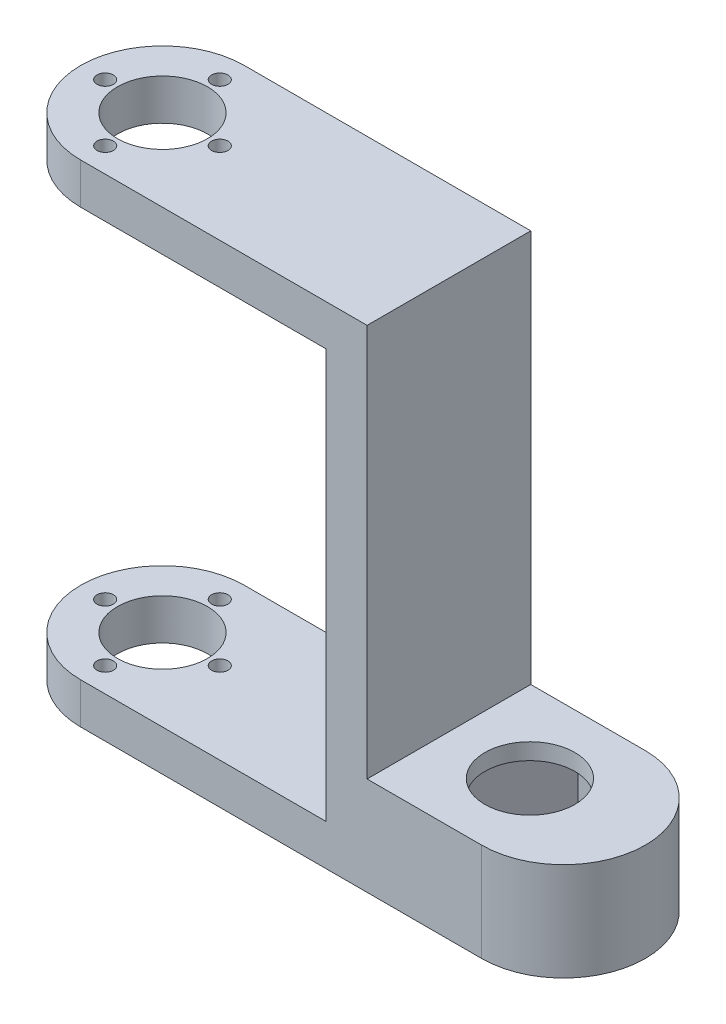
ISO-10303-21;
HEADER;
FILE_DESCRIPTION(('STEP AP214'),'2;1');
FILE_NAME('part.step','',(''),(''),'','','');
FILE_SCHEMA(('AUTOMOTIVE_DESIGN { 1 0 10303 214 1 1 1 1 }'));
ENDSEC;
DATA;
#1=APPLICATION_CONTEXT('core data for automotive mechanical design processes');
#2=APPLICATION_PROTOCOL_DEFINITION('international standard','automotive_design',2000,#1);
#3=PRODUCT_CONTEXT('',#1,'mechanical');
#4=PRODUCT('Part','Part','',(#3));
#5=PRODUCT_RELATED_PRODUCT_CATEGORY('part','',(#4));
#6=PRODUCT_DEFINITION_FORMATION('','',#4);
#7=PRODUCT_DEFINITION_CONTEXT('part definition',#1,'design');
#8=PRODUCT_DEFINITION('design','',#6,#7);
#9=PRODUCT_DEFINITION_SHAPE('','',#8);
#10=(LENGTH_UNIT() NAMED_UNIT(*) SI_UNIT(.MILLI.,.METRE.));
#11=(NAMED_UNIT(*) PLANE_ANGLE_UNIT() SI_UNIT($,.RADIAN.));
#12=(NAMED_UNIT(*) SI_UNIT($,.STERADIAN.) SOLID_ANGLE_UNIT());
#13=UNCERTAINTY_MEASURE_WITH_UNIT(LENGTH_MEASURE(1.E-05),#10,'distance_accuracy_value','');
#14=(GEOMETRIC_REPRESENTATION_CONTEXT(3) GLOBAL_UNCERTAINTY_ASSIGNED_CONTEXT((#13)) GLOBAL_UNIT_ASSIGNED_CONTEXT((#10,
#11,#12)) REPRESENTATION_CONTEXT('',''));
#15=CARTESIAN_POINT('',(0.,0.,0.));
#16=DIRECTION('',(0.,0.,1.));
#17=DIRECTION('',(1.,0.,0.));
#18=AXIS2_PLACEMENT_3D('',#15,#16,#17);
#19=CARTESIAN_POINT('',(36.5,-30.,10.));
#20=DIRECTION('',(0.,-1.,0.));
#21=DIRECTION('',(1.,0.,0.));
#22=AXIS2_PLACEMENT_3D('',#19,#20,#21);
#23=CYLINDRICAL_SURFACE('',#22,10.);
#24=DIRECTION('',(0.,-1.,0.));
#25=VECTOR('',#24,1.);
#26=CARTESIAN_POINT('',(36.5,0.,20.));
#27=LINE('',#26,#25);
#28=CARTESIAN_POINT('',(36.5,-30.,20.));
#29=VERTEX_POINT('',#28);
#30=CARTESIAN_POINT('',(36.5,-18.,20.));
#31=VERTEX_POINT('',#30);
#32=EDGE_CURVE('E331',#29,#31,#27,.F.);
#33=ORIENTED_EDGE('',*,*,#32,.F.);
#34=CARTESIAN_POINT('',(36.5,-30.,10.));
#35=DIRECTION('',(0.,1.,0.));
#36=DIRECTION('',(-1.,0.,0.));
#37=AXIS2_PLACEMENT_3D('',#34,#35,#36);
#38=CIRCLE('',#37,10.);
#39=CARTESIAN_POINT('',(36.5,-30.,0.));
#40=VERTEX_POINT('',#39);
#41=EDGE_CURVE('E49',#40,#29,#38,.F.);
#42=ORIENTED_EDGE('',*,*,#41,.F.);
#43=DIRECTION('',(0.,1.,0.));
#44=VECTOR('',#43,1.);
#45=CARTESIAN_POINT('',(36.5,-30.,0.));
#46=LINE('',#45,#44);
#47=CARTESIAN_POINT('',(36.5,-18.,0.));
#48=VERTEX_POINT('',#47);
#49=EDGE_CURVE('E346',#48,#40,#46,.F.);
#50=ORIENTED_EDGE('',*,*,#49,.F.);
#51=CARTESIAN_POINT('',(36.5,-18.,10.));
#52=DIRECTION('',(0.,-1.,0.));
#53=DIRECTION('',(1.,0.,0.));
#54=AXIS2_PLACEMENT_3D('',#51,#52,#53);
#55=CIRCLE('',#54,10.);
#56=EDGE_CURVE('E11',#31,#48,#55,.F.);
#57=ORIENTED_EDGE('',*,*,#56,.F.);
#58=EDGE_LOOP('',(#33,#42,#50,#57));
#59=FACE_BOUND('',#58,.T.);
#60=ADVANCED_FACE('F41',(#59),#23,.T.);
#61=CARTESIAN_POINT('',(-12.5,-25.,10.));
#62=DIRECTION('',(0.,-1.,0.));
#63=DIRECTION('',(1.,0.,0.));
#64=AXIS2_PLACEMENT_3D('',#61,#62,#63);
#65=CYLINDRICAL_SURFACE('',#64,10.);
#66=DIRECTION('',(0.,1.,0.));
#67=VECTOR('',#66,1.);
#68=CARTESIAN_POINT('',(-12.5,-25.,20.));
#69=LINE('',#68,#67);
#70=CARTESIAN_POINT('',(-12.5,-25.,20.));
#71=VERTEX_POINT('',#70);
#72=CARTESIAN_POINT('',(-12.5,-30.,20.));
#73=VERTEX_POINT('',#72);
#74=EDGE_CURVE('E321',#71,#73,#69,.F.);
#75=ORIENTED_EDGE('',*,*,#74,.F.);
#76=CARTESIAN_POINT('',(-12.5,-25.,10.));
#77=DIRECTION('',(0.,-1.,0.));
#78=DIRECTION('',(0.,0.,-1.));
#79=AXIS2_PLACEMENT_3D('',#76,#77,#78);
#80=CIRCLE('',#79,10.);
#81=CARTESIAN_POINT('',(-12.5,-25.,0.));
#82=VERTEX_POINT('',#81);
#83=EDGE_CURVE('E327',#82,#71,#80,.F.);
#84=ORIENTED_EDGE('',*,*,#83,.F.);
#85=DIRECTION('',(0.,-1.,0.));
#86=VECTOR('',#85,1.);
#87=CARTESIAN_POINT('',(-12.5000000000001,0.,0.));
#88=LINE('',#87,#86);
#89=CARTESIAN_POINT('',(-12.5,-30.,0.));
#90=VERTEX_POINT('',#89);
#91=EDGE_CURVE('E324',#90,#82,#88,.F.);
#92=ORIENTED_EDGE('',*,*,#91,.F.);
#93=CARTESIAN_POINT('',(-12.5,-30.,10.));
#94=DIRECTION('',(0.,1.,0.));
#95=DIRECTION('',(-1.,0.,0.));
#96=AXIS2_PLACEMENT_3D('',#93,#94,#95);
#97=CIRCLE('',#96,10.);
#98=EDGE_CURVE('E329',#73,#90,#97,.F.);
#99=ORIENTED_EDGE('',*,*,#98,.F.);
#100=EDGE_LOOP('',(#75,#84,#92,#99));
#101=FACE_BOUND('',#100,.T.);
#102=ADVANCED_FACE('F355',(#101),#65,.T.);
#103=CARTESIAN_POINT('',(-12.5,30.,10.));
#104=DIRECTION('',(0.,-1.,0.));
#105=DIRECTION('',(1.,0.,0.));
#106=AXIS2_PLACEMENT_3D('',#103,#104,#105);
#107=CYLINDRICAL_SURFACE('',#106,10.);
#108=DIRECTION('',(0.,1.,0.));
#109=VECTOR('',#108,1.);
#110=CARTESIAN_POINT('',(-12.5,30.,20.));
#111=LINE('',#110,#109);
#112=CARTESIAN_POINT('',(-12.5,30.,20.));
#113=VERTEX_POINT('',#112);
#114=CARTESIAN_POINT('',(-12.5,25.,20.));
#115=VERTEX_POINT('',#114);
#116=EDGE_CURVE('E311',#113,#115,#111,.F.);
#117=ORIENTED_EDGE('',*,*,#116,.F.);
#118=CARTESIAN_POINT('',(-12.5,30.,10.));
#119=DIRECTION('',(0.,-1.,0.));
#120=DIRECTION('',(1.,0.,0.));
#121=AXIS2_PLACEMENT_3D('',#118,#119,#120);
#122=CIRCLE('',#121,10.);
#123=CARTESIAN_POINT('',(-12.5,30.,0.));
#124=VERTEX_POINT('',#123);
#125=EDGE_CURVE('E317',#124,#113,#122,.F.);
#126=ORIENTED_EDGE('',*,*,#125,.F.);
#127=DIRECTION('',(0.,-1.,0.));
#128=VECTOR('',#127,1.);
#129=CARTESIAN_POINT('',(-12.5,0.,0.));
#130=LINE('',#129,#128);
#131=CARTESIAN_POINT('',(-12.5,25.,0.));
#132=VERTEX_POINT('',#131);
#133=EDGE_CURVE('E314',#132,#124,#130,.F.);
#134=ORIENTED_EDGE('',*,*,#133,.F.);
#135=CARTESIAN_POINT('',(-12.5,25.,10.));
#136=DIRECTION('',(0.,1.,0.));
#137=DIRECTION('',(-1.,0.,0.));
#138=AXIS2_PLACEMENT_3D('',#135,#136,#137);
#139=CIRCLE('',#138,10.);
#140=EDGE_CURVE('E319',#115,#132,#139,.F.);
#141=ORIENTED_EDGE('',*,*,#140,.F.);
#142=EDGE_LOOP('',(#117,#126,#134,#141));
#143=FACE_BOUND('',#142,.T.);
#144=ADVANCED_FACE('F374',(#143),#107,.T.);
#145=CARTESIAN_POINT('',(17.5,25.,20.));
#146=DIRECTION('',(1.,0.,0.));
#147=DIRECTION('',(0.,1.,0.));
#148=AXIS2_PLACEMENT_3D('',#145,#146,#147);
#149=PLANE('',#148);
#150=DIRECTION('',(0.,-1.,0.));
#151=VECTOR('',#150,1.);
#152=CARTESIAN_POINT('',(17.5,25.,0.));
#153=LINE('',#152,#151);
#154=CARTESIAN_POINT('',(17.5,25.,0.));
#155=VERTEX_POINT('',#154);
#156=CARTESIAN_POINT('',(17.5,-25.,0.));
#157=VERTEX_POINT('',#156);
#158=EDGE_CURVE('E270',#155,#157,#153,.T.);
#159=ORIENTED_EDGE('',*,*,#158,.T.);
#160=DIRECTION('',(0.,0.,-1.));
#161=VECTOR('',#160,1.);
#162=CARTESIAN_POINT('',(17.5,-25.,20.));
#163=LINE('',#162,#161);
#164=CARTESIAN_POINT('',(17.5,-25.,20.));
#165=VERTEX_POINT('',#164);
#166=EDGE_CURVE('E308',#165,#157,#163,.T.);
#167=ORIENTED_EDGE('',*,*,#166,.F.);
#168=DIRECTION('',(0.,-1.,0.));
#169=VECTOR('',#168,1.);
#170=CARTESIAN_POINT('',(17.5,25.,20.));
#171=LINE('',#170,#169);
#172=CARTESIAN_POINT('',(17.5,25.,20.));
#173=VERTEX_POINT('',#172);
#174=EDGE_CURVE('E271',#173,#165,#171,.T.);
#175=ORIENTED_EDGE('',*,*,#174,.F.);
#176=DIRECTION('',(0.,0.,-1.));
#177=VECTOR('',#176,1.);
#178=CARTESIAN_POINT('',(17.5,25.,20.));
#179=LINE('',#178,#177);
#180=EDGE_CURVE('E288',#173,#155,#179,.T.);
#181=ORIENTED_EDGE('',*,*,#180,.T.);
#182=EDGE_LOOP('',(#159,#167,#175,#181));
#183=FACE_BOUND('',#182,.T.);
#184=ADVANCED_FACE('F382',(#183),#149,.F.);
#185=CARTESIAN_POINT('',(-17.5,-25.,20.));
#186=DIRECTION('',(0.,-1.,0.));
#187=DIRECTION('',(0.,0.,-1.));
#188=AXIS2_PLACEMENT_3D('',#185,#186,#187);
#189=PLANE('',#188);
#190=CARTESIAN_POINT('',(-12.5,-25.,3.));
#191=DIRECTION('',(0.,-1.,0.));
#192=DIRECTION('',(0.,0.,-1.));
#193=AXIS2_PLACEMENT_3D('',#190,#191,#192);
#194=CIRCLE('',#193,1.);
#195=CARTESIAN_POINT('',(-12.5,-25.,2.));
#196=VERTEX_POINT('',#195);
#197=EDGE_CURVE('E267',#196,#196,#194,.T.);
#198=ORIENTED_EDGE('',*,*,#197,.T.);
#199=EDGE_LOOP('',(#198));
#200=FACE_BOUND('',#199,.T.);
#201=CARTESIAN_POINT('',(-12.5,-25.,10.));
#202=DIRECTION('',(0.,-1.,0.));
#203=DIRECTION('',(0.,0.,-1.));
#204=AXIS2_PLACEMENT_3D('',#201,#202,#203);
#205=CIRCLE('',#204,5.5);
#206=CARTESIAN_POINT('',(-12.5,-25.,4.5));
#207=VERTEX_POINT('',#206);
#208=EDGE_CURVE('E263',#207,#207,#205,.T.);
#209=ORIENTED_EDGE('',*,*,#208,.T.);
#210=EDGE_LOOP('',(#209));
#211=FACE_BOUND('',#210,.T.);
#212=CARTESIAN_POINT('',(-5.5,-25.,10.));
#213=DIRECTION('',(0.,-1.,0.));
#214=DIRECTION('',(0.,0.,-1.));
#215=AXIS2_PLACEMENT_3D('',#212,#213,#214);
#216=CIRCLE('',#215,1.);
#217=CARTESIAN_POINT('',(-5.5,-25.,9.));
#218=VERTEX_POINT('',#217);
#219=EDGE_CURVE('E259',#218,#218,#216,.T.);
#220=ORIENTED_EDGE('',*,*,#219,.T.);
#221=EDGE_LOOP('',(#220));
#222=FACE_BOUND('',#221,.T.);
#223=CARTESIAN_POINT('',(-12.5,-25.,17.));
#224=DIRECTION('',(0.,-1.,0.));
#225=DIRECTION('',(0.,0.,-1.));
#226=AXIS2_PLACEMENT_3D('',#223,#224,#225);
#227=CIRCLE('',#226,1.);
#228=CARTESIAN_POINT('',(-12.5,-25.,16.));
#229=VERTEX_POINT('',#228);
#230=EDGE_CURVE('E255',#229,#229,#227,.T.);
#231=ORIENTED_EDGE('',*,*,#230,.T.);
#232=EDGE_LOOP('',(#231));
#233=FACE_BOUND('',#232,.T.);
#234=CARTESIAN_POINT('',(-19.5,-25.,10.));
#235=DIRECTION('',(0.,-1.,0.));
#236=DIRECTION('',(0.,0.,-1.));
#237=AXIS2_PLACEMENT_3D('',#234,#235,#236);
#238=CIRCLE('',#237,1.);
#239=CARTESIAN_POINT('',(-19.5,-25.,9.));
#240=VERTEX_POINT('',#239);
#241=EDGE_CURVE('E251',#240,#240,#238,.T.);
#242=ORIENTED_EDGE('',*,*,#241,.T.);
#243=EDGE_LOOP('',(#242));
#244=FACE_BOUND('',#243,.T.);
#245=DIRECTION('',(-1.,0.,0.));
#246=VECTOR('',#245,1.);
#247=CARTESIAN_POINT('',(-17.5,-25.,0.));
#248=LINE('',#247,#246);
#249=EDGE_CURVE('E291',#157,#82,#248,.T.);
#250=ORIENTED_EDGE('',*,*,#249,.T.);
#251=ORIENTED_EDGE('',*,*,#83,.T.);
#252=DIRECTION('',(-1.,0.,0.));
#253=VECTOR('',#252,1.);
#254=CARTESIAN_POINT('',(-17.5,-25.,20.));
#255=LINE('',#254,#253);
#256=EDGE_CURVE('E274',#165,#71,#255,.T.);
#257=ORIENTED_EDGE('',*,*,#256,.F.);
#258=ORIENTED_EDGE('',*,*,#166,.T.);
#259=EDGE_LOOP('',(#250,#251,#257,#258));
#260=FACE_BOUND('',#259,.T.);
#261=ADVANCED_FACE('F385',(#200,#211,#222,#233,#244,#260),#189,.F.);
#262=CARTESIAN_POINT('',(-22.5,-30.,20.));
#263=DIRECTION('',(0.,1.,0.));
#264=DIRECTION('',(-1.,0.,0.));
#265=AXIS2_PLACEMENT_3D('',#262,#263,#264);
#266=PLANE('',#265);
#267=DIRECTION('',(0.500839461349423,0.,0.865540197769705));
#268=VECTOR('',#267,1.);
#269=CARTESIAN_POINT('',(39.6297855594556,-30.,1.09502198501677));
#270=LINE('',#269,#268);
#271=CARTESIAN_POINT('',(39.6297855594556,-30.,1.09502198501678));
#272=VERTEX_POINT('',#271);
#273=CARTESIAN_POINT('',(44.7768299608452,-30.,9.99003560296347));
#274=VERTEX_POINT('',#273);
#275=EDGE_CURVE('E192',#272,#274,#270,.T.);
#276=ORIENTED_EDGE('',*,*,#275,.F.);
#277=DIRECTION('',(0.999999529939883,0.,-0.000969597861462438));
#278=VECTOR('',#277,1.);
#279=CARTESIAN_POINT('',(29.3529555986104,-30.,1.10498638205329));
#280=LINE('',#279,#278);
#281=CARTESIAN_POINT('',(29.3529555986104,-30.,1.10498638205329));
#282=VERTEX_POINT('',#281);
#283=EDGE_CURVE('E158',#282,#272,#280,.T.);
#284=ORIENTED_EDGE('',*,*,#283,.F.);
#285=DIRECTION('',(0.49916006859046,0.,-0.866509795631167));
#286=VECTOR('',#285,1.);
#287=CARTESIAN_POINT('',(24.2231700391548,-30.,10.0099643970365));
#288=LINE('',#287,#286);
#289=CARTESIAN_POINT('',(24.2231700391548,-30.,10.0099643970365));
#290=VERTEX_POINT('',#289);
#291=EDGE_CURVE('E176',#290,#282,#288,.T.);
#292=ORIENTED_EDGE('',*,*,#291,.F.);
#293=DIRECTION('',(-0.500839461349423,0.,-0.865540197769705));
#294=VECTOR('',#293,1.);
#295=CARTESIAN_POINT('',(29.3702144405444,-30.,18.9049780149832));
#296=LINE('',#295,#294);
#297=CARTESIAN_POINT('',(29.3702144405444,-30.,18.9049780149832));
#298=VERTEX_POINT('',#297);
#299=EDGE_CURVE('E179',#298,#290,#296,.T.);
#300=ORIENTED_EDGE('',*,*,#299,.F.);
#301=DIRECTION('',(-0.999999529939883,0.,0.000969597861462271));
#302=VECTOR('',#301,1.);
#303=CARTESIAN_POINT('',(39.6470444013896,-30.,18.8950136179467));
#304=LINE('',#303,#302);
#305=CARTESIAN_POINT('',(39.6470444013896,-30.,18.8950136179467));
#306=VERTEX_POINT('',#305);
#307=EDGE_CURVE('E198',#306,#298,#304,.T.);
#308=ORIENTED_EDGE('',*,*,#307,.F.);
#309=DIRECTION('',(-0.499160068590461,0.,0.866509795631167));
#310=VECTOR('',#309,1.);
#311=CARTESIAN_POINT('',(44.7768299608452,-30.,9.99003560296347));
#312=LINE('',#311,#310);
#313=EDGE_CURVE('E195',#274,#306,#312,.T.);
#314=ORIENTED_EDGE('',*,*,#313,.F.);
#315=EDGE_LOOP('',(#276,#284,#292,#300,#308,#314));
#316=FACE_BOUND('',#315,.T.);
#317=CARTESIAN_POINT('',(-12.5,-30.,3.));
#318=DIRECTION('',(0.,1.,0.));
#319=DIRECTION('',(-1.,0.,0.));
#320=AXIS2_PLACEMENT_3D('',#317,#318,#319);
#321=CIRCLE('',#320,1.);
#322=CARTESIAN_POINT('',(-13.5,-30.,3.));
#323=VERTEX_POINT('',#322);
#324=EDGE_CURVE('E221',#323,#323,#321,.T.);
#325=ORIENTED_EDGE('',*,*,#324,.T.);
#326=EDGE_LOOP('',(#325));
#327=FACE_BOUND('',#326,.T.);
#328=CARTESIAN_POINT('',(-12.5,-30.,10.));
#329=DIRECTION('',(0.,1.,0.));
#330=DIRECTION('',(-1.,0.,0.));
#331=AXIS2_PLACEMENT_3D('',#328,#329,#330);
#332=CIRCLE('',#331,5.5);
#333=CARTESIAN_POINT('',(-18.,-30.,10.));
#334=VERTEX_POINT('',#333);
#335=EDGE_CURVE('E236',#334,#334,#332,.T.);
#336=ORIENTED_EDGE('',*,*,#335,.T.);
#337=EDGE_LOOP('',(#336));
#338=FACE_BOUND('',#337,.T.);
#339=CARTESIAN_POINT('',(-5.5,-30.,10.));
#340=DIRECTION('',(0.,1.,0.));
#341=DIRECTION('',(-1.,0.,0.));
#342=AXIS2_PLACEMENT_3D('',#339,#340,#341);
#343=CIRCLE('',#342,1.);
#344=CARTESIAN_POINT('',(-6.5,-30.,10.));
#345=VERTEX_POINT('',#344);
#346=EDGE_CURVE('E229',#345,#345,#343,.T.);
#347=ORIENTED_EDGE('',*,*,#346,.T.);
#348=EDGE_LOOP('',(#347));
#349=FACE_BOUND('',#348,.T.);
#350=CARTESIAN_POINT('',(-12.5,-30.,17.));
#351=DIRECTION('',(0.,1.,0.));
#352=DIRECTION('',(-1.,0.,0.));
#353=AXIS2_PLACEMENT_3D('',#350,#351,#352);
#354=CIRCLE('',#353,1.);
#355=CARTESIAN_POINT('',(-13.5,-30.,17.));
#356=VERTEX_POINT('',#355);
#357=EDGE_CURVE('E246',#356,#356,#354,.T.);
#358=ORIENTED_EDGE('',*,*,#357,.T.);
#359=EDGE_LOOP('',(#358));
#360=FACE_BOUND('',#359,.T.);
#361=CARTESIAN_POINT('',(-19.5,-30.,10.));
#362=DIRECTION('',(0.,1.,0.));
#363=DIRECTION('',(-1.,0.,0.));
#364=AXIS2_PLACEMENT_3D('',#361,#362,#363);
#365=CIRCLE('',#364,1.);
#366=CARTESIAN_POINT('',(-20.5,-30.,10.));
#367=VERTEX_POINT('',#366);
#368=EDGE_CURVE('E228',#367,#367,#365,.T.);
#369=ORIENTED_EDGE('',*,*,#368,.T.);
#370=EDGE_LOOP('',(#369));
#371=FACE_BOUND('',#370,.T.);
#372=DIRECTION('',(1.,0.,0.));
#373=VECTOR('',#372,1.);
#374=CARTESIAN_POINT('',(-22.5,-30.,0.));
#375=LINE('',#374,#373);
#376=EDGE_CURVE('E294',#90,#40,#375,.T.);
#377=ORIENTED_EDGE('',*,*,#376,.T.);
#378=ORIENTED_EDGE('',*,*,#41,.T.);
#379=DIRECTION('',(1.,0.,0.));
#380=VECTOR('',#379,1.);
#381=CARTESIAN_POINT('',(-22.5,-30.,20.));
#382=LINE('',#381,#380);
#383=EDGE_CURVE('E278',#73,#29,#382,.T.);
#384=ORIENTED_EDGE('',*,*,#383,.F.);
#385=ORIENTED_EDGE('',*,*,#98,.T.);
#386=EDGE_LOOP('',(#377,#378,#384,#385));
#387=FACE_BOUND('',#386,.T.);
#388=ADVANCED_FACE('F349',(#316,#327,#338,#349,#360,#371,#387),#266,.F.);
#389=CARTESIAN_POINT('',(22.5,30.,20.));
#390=DIRECTION('',(-1.,0.,0.));
#391=DIRECTION('',(0.,-1.,0.));
#392=AXIS2_PLACEMENT_3D('',#389,#390,#391);
#393=PLANE('',#392);
#394=DIRECTION('',(0.,1.,0.));
#395=VECTOR('',#394,1.);
#396=CARTESIAN_POINT('',(22.5,30.,20.));
#397=LINE('',#396,#395);
#398=CARTESIAN_POINT('',(22.5,-18.,20.));
#399=VERTEX_POINT('',#398);
#400=CARTESIAN_POINT('',(22.5,30.,20.));
#401=VERTEX_POINT('',#400);
#402=EDGE_CURVE('E281',#399,#401,#397,.T.);
#403=ORIENTED_EDGE('',*,*,#402,.F.);
#404=DIRECTION('',(0.,0.,-1.));
#405=VECTOR('',#404,1.);
#406=CARTESIAN_POINT('',(22.5,-18.,20.));
#407=LINE('',#406,#405);
#408=CARTESIAN_POINT('',(22.5,-18.,0.));
#409=VERTEX_POINT('',#408);
#410=EDGE_CURVE('E205',#399,#409,#407,.T.);
#411=ORIENTED_EDGE('',*,*,#410,.T.);
#412=DIRECTION('',(0.,1.,0.));
#413=VECTOR('',#412,1.);
#414=CARTESIAN_POINT('',(22.5,30.,0.));
#415=LINE('',#414,#413);
#416=CARTESIAN_POINT('',(22.5,30.,0.));
#417=VERTEX_POINT('',#416);
#418=EDGE_CURVE('E297',#409,#417,#415,.T.);
#419=ORIENTED_EDGE('',*,*,#418,.T.);
#420=DIRECTION('',(0.,0.,-1.));
#421=VECTOR('',#420,1.);
#422=CARTESIAN_POINT('',(22.5,30.,20.));
#423=LINE('',#422,#421);
#424=EDGE_CURVE('E305',#401,#417,#423,.T.);
#425=ORIENTED_EDGE('',*,*,#424,.F.);
#426=EDGE_LOOP('',(#403,#411,#419,#425));
#427=FACE_BOUND('',#426,.T.);
#428=ADVANCED_FACE('F365',(#427),#393,.F.);
#429=CARTESIAN_POINT('',(-22.5,30.,20.));
#430=DIRECTION('',(0.,-1.,0.));
#431=DIRECTION('',(1.,0.,0.));
#432=AXIS2_PLACEMENT_3D('',#429,#430,#431);
#433=PLANE('',#432);
#434=CARTESIAN_POINT('',(-12.5,30.,3.));
#435=DIRECTION('',(0.,1.,0.));
#436=DIRECTION('',(-1.,0.,0.));
#437=AXIS2_PLACEMENT_3D('',#434,#435,#436);
#438=CIRCLE('',#437,1.);
#439=CARTESIAN_POINT('',(-13.5,30.,3.));
#440=VERTEX_POINT('',#439);
#441=EDGE_CURVE('E225',#440,#440,#438,.T.);
#442=ORIENTED_EDGE('',*,*,#441,.F.);
#443=EDGE_LOOP('',(#442));
#444=FACE_BOUND('',#443,.T.);
#445=CARTESIAN_POINT('',(-12.5,30.,10.));
#446=DIRECTION('',(0.,1.,0.));
#447=DIRECTION('',(-1.,0.,0.));
#448=AXIS2_PLACEMENT_3D('',#445,#446,#447);
#449=CIRCLE('',#448,5.5);
#450=CARTESIAN_POINT('',(-18.,30.,10.));
#451=VERTEX_POINT('',#450);
#452=EDGE_CURVE('E220',#451,#451,#449,.T.);
#453=ORIENTED_EDGE('',*,*,#452,.F.);
#454=EDGE_LOOP('',(#453));
#455=FACE_BOUND('',#454,.T.);
#456=CARTESIAN_POINT('',(-5.50000000000001,30.,10.));
#457=DIRECTION('',(0.,1.,0.));
#458=DIRECTION('',(-1.,0.,0.));
#459=AXIS2_PLACEMENT_3D('',#456,#457,#458);
#460=CIRCLE('',#459,1.);
#461=CARTESIAN_POINT('',(-6.50000000000001,30.,10.));
#462=VERTEX_POINT('',#461);
#463=EDGE_CURVE('E233',#462,#462,#460,.T.);
#464=ORIENTED_EDGE('',*,*,#463,.F.);
#465=EDGE_LOOP('',(#464));
#466=FACE_BOUND('',#465,.T.);
#467=CARTESIAN_POINT('',(-12.5,30.,17.));
#468=DIRECTION('',(0.,1.,0.));
#469=DIRECTION('',(-1.,0.,0.));
#470=AXIS2_PLACEMENT_3D('',#467,#468,#469);
#471=CIRCLE('',#470,1.);
#472=CARTESIAN_POINT('',(-13.5,30.,17.));
#473=VERTEX_POINT('',#472);
#474=EDGE_CURVE('E232',#473,#473,#471,.T.);
#475=ORIENTED_EDGE('',*,*,#474,.F.);
#476=EDGE_LOOP('',(#475));
#477=FACE_BOUND('',#476,.T.);
#478=CARTESIAN_POINT('',(-19.5,30.,10.));
#479=DIRECTION('',(0.,1.,0.));
#480=DIRECTION('',(-1.,0.,0.));
#481=AXIS2_PLACEMENT_3D('',#478,#479,#480);
#482=CIRCLE('',#481,1.);
#483=CARTESIAN_POINT('',(-20.5,30.,10.));
#484=VERTEX_POINT('',#483);
#485=EDGE_CURVE('E243',#484,#484,#482,.T.);
#486=ORIENTED_EDGE('',*,*,#485,.F.);
#487=EDGE_LOOP('',(#486));
#488=FACE_BOUND('',#487,.T.);
#489=DIRECTION('',(-1.,0.,0.));
#490=VECTOR('',#489,1.);
#491=CARTESIAN_POINT('',(-22.5,30.,0.));
#492=LINE('',#491,#490);
#493=EDGE_CURVE('E299',#417,#124,#492,.T.);
#494=ORIENTED_EDGE('',*,*,#493,.T.);
#495=ORIENTED_EDGE('',*,*,#125,.T.);
#496=DIRECTION('',(-1.,0.,0.));
#497=VECTOR('',#496,1.);
#498=CARTESIAN_POINT('',(-22.5,30.,20.));
#499=LINE('',#498,#497);
#500=EDGE_CURVE('E283',#401,#113,#499,.T.);
#501=ORIENTED_EDGE('',*,*,#500,.F.);
#502=ORIENTED_EDGE('',*,*,#424,.T.);
#503=EDGE_LOOP('',(#494,#495,#501,#502));
#504=FACE_BOUND('',#503,.T.);
#505=ADVANCED_FACE('F371',(#444,#455,#466,#477,#488,#504),#433,.F.);
#506=CARTESIAN_POINT('',(-17.5,25.,20.));
#507=DIRECTION('',(0.,1.,0.));
#508=DIRECTION('',(-1.,0.,0.));
#509=AXIS2_PLACEMENT_3D('',#506,#507,#508);
#510=PLANE('',#509);
#511=CARTESIAN_POINT('',(-12.5,25.,3.));
#512=DIRECTION('',(0.,1.,0.));
#513=DIRECTION('',(-1.,0.,0.));
#514=AXIS2_PLACEMENT_3D('',#511,#512,#513);
#515=CIRCLE('',#514,1.);
#516=CARTESIAN_POINT('',(-13.5,25.,3.));
#517=VERTEX_POINT('',#516);
#518=EDGE_CURVE('E266',#517,#517,#515,.T.);
#519=ORIENTED_EDGE('',*,*,#518,.T.);
#520=EDGE_LOOP('',(#519));
#521=FACE_BOUND('',#520,.T.);
#522=CARTESIAN_POINT('',(-12.5,25.,10.));
#523=DIRECTION('',(0.,1.,0.));
#524=DIRECTION('',(-1.,0.,0.));
#525=AXIS2_PLACEMENT_3D('',#522,#523,#524);
#526=CIRCLE('',#525,5.5);
#527=CARTESIAN_POINT('',(-18.,25.,10.));
#528=VERTEX_POINT('',#527);
#529=EDGE_CURVE('E262',#528,#528,#526,.T.);
#530=ORIENTED_EDGE('',*,*,#529,.T.);
#531=EDGE_LOOP('',(#530));
#532=FACE_BOUND('',#531,.T.);
#533=CARTESIAN_POINT('',(-5.50000000000001,25.,10.));
#534=DIRECTION('',(0.,1.,0.));
#535=DIRECTION('',(-1.,0.,0.));
#536=AXIS2_PLACEMENT_3D('',#533,#534,#535);
#537=CIRCLE('',#536,1.);
#538=CARTESIAN_POINT('',(-6.50000000000001,25.,10.));
#539=VERTEX_POINT('',#538);
#540=EDGE_CURVE('E258',#539,#539,#537,.T.);
#541=ORIENTED_EDGE('',*,*,#540,.T.);
#542=EDGE_LOOP('',(#541));
#543=FACE_BOUND('',#542,.T.);
#544=CARTESIAN_POINT('',(-12.5,25.,17.));
#545=DIRECTION('',(0.,1.,0.));
#546=DIRECTION('',(-1.,0.,0.));
#547=AXIS2_PLACEMENT_3D('',#544,#545,#546);
#548=CIRCLE('',#547,1.);
#549=CARTESIAN_POINT('',(-13.5,25.,17.));
#550=VERTEX_POINT('',#549);
#551=EDGE_CURVE('E254',#550,#550,#548,.T.);
#552=ORIENTED_EDGE('',*,*,#551,.T.);
#553=EDGE_LOOP('',(#552));
#554=FACE_BOUND('',#553,.T.);
#555=CARTESIAN_POINT('',(-19.5,25.,10.));
#556=DIRECTION('',(0.,1.,0.));
#557=DIRECTION('',(-1.,0.,0.));
#558=AXIS2_PLACEMENT_3D('',#555,#556,#557);
#559=CIRCLE('',#558,1.);
#560=CARTESIAN_POINT('',(-20.5,25.,10.));
#561=VERTEX_POINT('',#560);
#562=EDGE_CURVE('E224',#561,#561,#559,.T.);
#563=ORIENTED_EDGE('',*,*,#562,.T.);
#564=EDGE_LOOP('',(#563));
#565=FACE_BOUND('',#564,.T.);
#566=DIRECTION('',(1.,0.,0.));
#567=VECTOR('',#566,1.);
#568=CARTESIAN_POINT('',(-17.5,25.,20.));
#569=LINE('',#568,#567);
#570=EDGE_CURVE('E286',#115,#173,#569,.T.);
#571=ORIENTED_EDGE('',*,*,#570,.F.);
#572=ORIENTED_EDGE('',*,*,#140,.T.);
#573=DIRECTION('',(1.,0.,0.));
#574=VECTOR('',#573,1.);
#575=CARTESIAN_POINT('',(-17.5,25.,0.));
#576=LINE('',#575,#574);
#577=EDGE_CURVE('E275',#132,#155,#576,.T.);
#578=ORIENTED_EDGE('',*,*,#577,.T.);
#579=ORIENTED_EDGE('',*,*,#180,.F.);
#580=EDGE_LOOP('',(#571,#572,#578,#579));
#581=FACE_BOUND('',#580,.T.);
#582=ADVANCED_FACE('F377',(#521,#532,#543,#554,#565,#581),#510,.F.);
#583=CARTESIAN_POINT('',(0.,0.,20.));
#584=DIRECTION('',(0.,0.,1.));
#585=DIRECTION('',(1.,0.,0.));
#586=AXIS2_PLACEMENT_3D('',#583,#584,#585);
#587=PLANE('',#586);
#588=ORIENTED_EDGE('',*,*,#383,.T.);
#589=ORIENTED_EDGE('',*,*,#32,.T.);
#590=DIRECTION('',(-1.,0.,0.));
#591=VECTOR('',#590,1.);
#592=CARTESIAN_POINT('',(22.5,-18.,20.));
#593=LINE('',#592,#591);
#594=EDGE_CURVE('E218',#31,#399,#593,.T.);
#595=ORIENTED_EDGE('',*,*,#594,.T.);
#596=ORIENTED_EDGE('',*,*,#402,.T.);
#597=ORIENTED_EDGE('',*,*,#500,.T.);
#598=ORIENTED_EDGE('',*,*,#116,.T.);
#599=ORIENTED_EDGE('',*,*,#570,.T.);
#600=ORIENTED_EDGE('',*,*,#174,.T.);
#601=ORIENTED_EDGE('',*,*,#256,.T.);
#602=ORIENTED_EDGE('',*,*,#74,.T.);
#603=EDGE_LOOP('',(#588,#589,#595,#596,#597,#598,#599,#600,#601,#602));
#604=FACE_BOUND('',#603,.T.);
#605=ADVANCED_FACE('F352',(#604),#587,.T.);
#606=CARTESIAN_POINT('',(0.,0.,0.));
#607=DIRECTION('',(0.,0.,1.));
#608=DIRECTION('',(1.,0.,0.));
#609=AXIS2_PLACEMENT_3D('',#606,#607,#608);
#610=PLANE('',#609);
#611=DIRECTION('',(1.,0.,0.));
#612=VECTOR('',#611,1.);
#613=CARTESIAN_POINT('',(22.5,-18.,0.));
#614=LINE('',#613,#612);
#615=EDGE_CURVE('E215',#409,#48,#614,.T.);
#616=ORIENTED_EDGE('',*,*,#615,.T.);
#617=ORIENTED_EDGE('',*,*,#49,.T.);
#618=ORIENTED_EDGE('',*,*,#376,.F.);
#619=ORIENTED_EDGE('',*,*,#91,.T.);
#620=ORIENTED_EDGE('',*,*,#249,.F.);
#621=ORIENTED_EDGE('',*,*,#158,.F.);
#622=ORIENTED_EDGE('',*,*,#577,.F.);
#623=ORIENTED_EDGE('',*,*,#133,.T.);
#624=ORIENTED_EDGE('',*,*,#493,.F.);
#625=ORIENTED_EDGE('',*,*,#418,.F.);
#626=EDGE_LOOP('',(#616,#617,#618,#619,#620,#621,#622,#623,#624,#625));
#627=FACE_BOUND('',#626,.T.);
#628=ADVANCED_FACE('F358',(#627),#610,.F.);
#629=CARTESIAN_POINT('',(-19.5,-30.,10.));
#630=DIRECTION('',(0.,1.,0.));
#631=DIRECTION('',(-1.,0.,0.));
#632=AXIS2_PLACEMENT_3D('',#629,#630,#631);
#633=CYLINDRICAL_SURFACE('',#632,1.);
#634=ORIENTED_EDGE('',*,*,#485,.T.);
#635=EDGE_LOOP('',(#634));
#636=FACE_BOUND('',#635,.T.);
#637=ORIENTED_EDGE('',*,*,#562,.F.);
#638=EDGE_LOOP('',(#637));
#639=FACE_BOUND('',#638,.T.);
#640=ADVANCED_FACE('F481',(#636,#639),#633,.F.);
#641=CARTESIAN_POINT('',(-12.5,-30.,17.));
#642=DIRECTION('',(0.,1.,0.));
#643=DIRECTION('',(-1.,0.,0.));
#644=AXIS2_PLACEMENT_3D('',#641,#642,#643);
#645=CYLINDRICAL_SURFACE('',#644,1.);
#646=ORIENTED_EDGE('',*,*,#474,.T.);
#647=EDGE_LOOP('',(#646));
#648=FACE_BOUND('',#647,.T.);
#649=ORIENTED_EDGE('',*,*,#551,.F.);
#650=EDGE_LOOP('',(#649));
#651=FACE_BOUND('',#650,.T.);
#652=ADVANCED_FACE('F498',(#648,#651),#645,.F.);
#653=CARTESIAN_POINT('',(-5.5,-30.,10.));
#654=DIRECTION('',(0.,1.,0.));
#655=DIRECTION('',(-1.,0.,0.));
#656=AXIS2_PLACEMENT_3D('',#653,#654,#655);
#657=CYLINDRICAL_SURFACE('',#656,1.);
#658=ORIENTED_EDGE('',*,*,#463,.T.);
#659=EDGE_LOOP('',(#658));
#660=FACE_BOUND('',#659,.T.);
#661=ORIENTED_EDGE('',*,*,#540,.F.);
#662=EDGE_LOOP('',(#661));
#663=FACE_BOUND('',#662,.T.);
#664=ADVANCED_FACE('F508',(#660,#663),#657,.F.);
#665=CARTESIAN_POINT('',(-12.5,-30.,10.));
#666=DIRECTION('',(0.,1.,0.));
#667=DIRECTION('',(-1.,0.,0.));
#668=AXIS2_PLACEMENT_3D('',#665,#666,#667);
#669=CYLINDRICAL_SURFACE('',#668,5.5);
#670=ORIENTED_EDGE('',*,*,#452,.T.);
#671=EDGE_LOOP('',(#670));
#672=FACE_BOUND('',#671,.T.);
#673=ORIENTED_EDGE('',*,*,#529,.F.);
#674=EDGE_LOOP('',(#673));
#675=FACE_BOUND('',#674,.T.);
#676=ADVANCED_FACE('F518',(#672,#675),#669,.F.);
#677=CARTESIAN_POINT('',(-12.5,-30.,3.));
#678=DIRECTION('',(0.,1.,0.));
#679=DIRECTION('',(-1.,0.,0.));
#680=AXIS2_PLACEMENT_3D('',#677,#678,#679);
#681=CYLINDRICAL_SURFACE('',#680,1.);
#682=ORIENTED_EDGE('',*,*,#441,.T.);
#683=EDGE_LOOP('',(#682));
#684=FACE_BOUND('',#683,.T.);
#685=ORIENTED_EDGE('',*,*,#518,.F.);
#686=EDGE_LOOP('',(#685));
#687=FACE_BOUND('',#686,.T.);
#688=ADVANCED_FACE('F528',(#684,#687),#681,.F.);
#689=ORIENTED_EDGE('',*,*,#368,.F.);
#690=EDGE_LOOP('',(#689));
#691=FACE_BOUND('',#690,.T.);
#692=ORIENTED_EDGE('',*,*,#241,.F.);
#693=EDGE_LOOP('',(#692));
#694=FACE_BOUND('',#693,.T.);
#695=ADVANCED_FACE('F501',(#691,#694),#633,.F.);
#696=ORIENTED_EDGE('',*,*,#357,.F.);
#697=EDGE_LOOP('',(#696));
#698=FACE_BOUND('',#697,.T.);
#699=ORIENTED_EDGE('',*,*,#230,.F.);
#700=EDGE_LOOP('',(#699));
#701=FACE_BOUND('',#700,.T.);
#702=ADVANCED_FACE('F511',(#698,#701),#645,.F.);
#703=ORIENTED_EDGE('',*,*,#346,.F.);
#704=EDGE_LOOP('',(#703));
#705=FACE_BOUND('',#704,.T.);
#706=ORIENTED_EDGE('',*,*,#219,.F.);
#707=EDGE_LOOP('',(#706));
#708=FACE_BOUND('',#707,.T.);
#709=ADVANCED_FACE('F521',(#705,#708),#657,.F.);
#710=ORIENTED_EDGE('',*,*,#335,.F.);
#711=EDGE_LOOP('',(#710));
#712=FACE_BOUND('',#711,.T.);
#713=ORIENTED_EDGE('',*,*,#208,.F.);
#714=EDGE_LOOP('',(#713));
#715=FACE_BOUND('',#714,.T.);
#716=ADVANCED_FACE('F531',(#712,#715),#669,.F.);
#717=ORIENTED_EDGE('',*,*,#324,.F.);
#718=EDGE_LOOP('',(#717));
#719=FACE_BOUND('',#718,.T.);
#720=ORIENTED_EDGE('',*,*,#197,.F.);
#721=EDGE_LOOP('',(#720));
#722=FACE_BOUND('',#721,.T.);
#723=ADVANCED_FACE('F540',(#719,#722),#681,.F.);
#724=CARTESIAN_POINT('',(0.,-18.,0.));
#725=DIRECTION('',(0.,-1.,0.));
#726=DIRECTION('',(1.,0.,0.));
#727=AXIS2_PLACEMENT_3D('',#724,#725,#726);
#728=PLANE('',#727);
#729=CARTESIAN_POINT('',(32.3903591301354,-18.,10.));
#730=DIRECTION('',(0.,-1.,0.));
#731=DIRECTION('',(1.,0.,0.));
#732=AXIS2_PLACEMENT_3D('',#729,#730,#731);
#733=CIRCLE('',#732,5.5);
#734=CARTESIAN_POINT('',(37.8903591301354,-18.,10.));
#735=VERTEX_POINT('',#734);
#736=EDGE_CURVE('E193',#735,#735,#733,.T.);
#737=ORIENTED_EDGE('',*,*,#736,.T.);
#738=EDGE_LOOP('',(#737));
#739=FACE_BOUND('',#738,.T.);
#740=ORIENTED_EDGE('',*,*,#594,.F.);
#741=ORIENTED_EDGE('',*,*,#56,.T.);
#742=ORIENTED_EDGE('',*,*,#615,.F.);
#743=ORIENTED_EDGE('',*,*,#410,.F.);
#744=EDGE_LOOP('',(#740,#741,#742,#743));
#745=FACE_BOUND('',#744,.T.);
#746=ADVANCED_FACE('F362',(#739,#745),#728,.F.);
#747=CARTESIAN_POINT('',(29.3529555986104,-20.,1.10498638205329));
#748=DIRECTION('',(-0.000969597861462438,0.,-0.999999529939883));
#749=DIRECTION('',(-0.999999529939883,0.,0.000969597861462438));
#750=AXIS2_PLACEMENT_3D('',#747,#748,#749);
#751=PLANE('',#750);
#752=ORIENTED_EDGE('',*,*,#283,.T.);
#753=DIRECTION('',(0.,-1.,0.));
#754=VECTOR('',#753,1.);
#755=CARTESIAN_POINT('',(39.6297855594556,-20.,1.09502198501677));
#756=LINE('',#755,#754);
#757=CARTESIAN_POINT('',(39.6297855594556,-20.,1.09502198501677));
#758=VERTEX_POINT('',#757);
#759=EDGE_CURVE('E151',#758,#272,#756,.T.);
#760=ORIENTED_EDGE('',*,*,#759,.F.);
#761=DIRECTION('',(0.999999529939883,0.,-0.000969597861462438));
#762=VECTOR('',#761,1.);
#763=CARTESIAN_POINT('',(29.3529555986104,-20.,1.10498638205329));
#764=LINE('',#763,#762);
#765=CARTESIAN_POINT('',(29.3529555986104,-20.,1.10498638205329));
#766=VERTEX_POINT('',#765);
#767=EDGE_CURVE('E155',#766,#758,#764,.T.);
#768=ORIENTED_EDGE('',*,*,#767,.F.);
#769=DIRECTION('',(0.,-1.,0.));
#770=VECTOR('',#769,1.);
#771=CARTESIAN_POINT('',(29.3529555986104,-20.,1.10498638205329));
#772=LINE('',#771,#770);
#773=EDGE_CURVE('E203',#766,#282,#772,.T.);
#774=ORIENTED_EDGE('',*,*,#773,.T.);
#775=EDGE_LOOP('',(#752,#760,#768,#774));
#776=FACE_BOUND('',#775,.T.);
#777=ADVANCED_FACE('F153',(#776),#751,.F.);
#778=CARTESIAN_POINT('',(24.2231700391548,-20.,10.0099643970365));
#779=DIRECTION('',(-0.866509795631167,0.,-0.49916006859046));
#780=DIRECTION('',(-0.49916006859046,0.,0.866509795631167));
#781=AXIS2_PLACEMENT_3D('',#778,#779,#780);
#782=PLANE('',#781);
#783=ORIENTED_EDGE('',*,*,#291,.T.);
#784=ORIENTED_EDGE('',*,*,#773,.F.);
#785=DIRECTION('',(0.49916006859046,0.,-0.866509795631167));
#786=VECTOR('',#785,1.);
#787=CARTESIAN_POINT('',(24.2231700391548,-20.,10.0099643970365));
#788=LINE('',#787,#786);
#789=CARTESIAN_POINT('',(24.2231700391548,-20.,10.0099643970365));
#790=VERTEX_POINT('',#789);
#791=EDGE_CURVE('E163',#790,#766,#788,.T.);
#792=ORIENTED_EDGE('',*,*,#791,.F.);
#793=DIRECTION('',(0.,-1.,0.));
#794=VECTOR('',#793,1.);
#795=CARTESIAN_POINT('',(24.2231700391548,-20.,10.0099643970365));
#796=LINE('',#795,#794);
#797=EDGE_CURVE('E206',#790,#290,#796,.T.);
#798=ORIENTED_EDGE('',*,*,#797,.T.);
#799=EDGE_LOOP('',(#783,#784,#792,#798));
#800=FACE_BOUND('',#799,.T.);
#801=ADVANCED_FACE('F585',(#800),#782,.F.);
#802=CARTESIAN_POINT('',(29.3702144405444,-20.,18.9049780149832));
#803=DIRECTION('',(-0.865540197769705,0.,0.500839461349423));
#804=DIRECTION('',(0.500839461349423,0.,0.865540197769705));
#805=AXIS2_PLACEMENT_3D('',#802,#803,#804);
#806=PLANE('',#805);
#807=ORIENTED_EDGE('',*,*,#299,.T.);
#808=ORIENTED_EDGE('',*,*,#797,.F.);
#809=DIRECTION('',(-0.500839461349423,0.,-0.865540197769705));
#810=VECTOR('',#809,1.);
#811=CARTESIAN_POINT('',(29.3702144405444,-20.,18.9049780149832));
#812=LINE('',#811,#810);
#813=CARTESIAN_POINT('',(29.3702144405444,-20.,18.9049780149832));
#814=VERTEX_POINT('',#813);
#815=EDGE_CURVE('E188',#814,#790,#812,.T.);
#816=ORIENTED_EDGE('',*,*,#815,.F.);
#817=DIRECTION('',(0.,-1.,0.));
#818=VECTOR('',#817,1.);
#819=CARTESIAN_POINT('',(29.3702144405444,-20.,18.9049780149832));
#820=LINE('',#819,#818);
#821=EDGE_CURVE('E208',#814,#298,#820,.T.);
#822=ORIENTED_EDGE('',*,*,#821,.T.);
#823=EDGE_LOOP('',(#807,#808,#816,#822));
#824=FACE_BOUND('',#823,.T.);
#825=ADVANCED_FACE('F592',(#824),#806,.F.);
#826=CARTESIAN_POINT('',(39.6470444013896,-20.,18.8950136179467));
#827=DIRECTION('',(0.000969597861462271,0.,0.999999529939883));
#828=DIRECTION('',(0.999999529939883,0.,-0.000969597861462271));
#829=AXIS2_PLACEMENT_3D('',#826,#827,#828);
#830=PLANE('',#829);
#831=ORIENTED_EDGE('',*,*,#307,.T.);
#832=ORIENTED_EDGE('',*,*,#821,.F.);
#833=DIRECTION('',(-0.999999529939883,0.,0.000969597861462271));
#834=VECTOR('',#833,1.);
#835=CARTESIAN_POINT('',(39.6470444013896,-20.,18.8950136179467));
#836=LINE('',#835,#834);
#837=CARTESIAN_POINT('',(39.6470444013896,-20.,18.8950136179467));
#838=VERTEX_POINT('',#837);
#839=EDGE_CURVE('E185',#838,#814,#836,.T.);
#840=ORIENTED_EDGE('',*,*,#839,.F.);
#841=DIRECTION('',(0.,-1.,0.));
#842=VECTOR('',#841,1.);
#843=CARTESIAN_POINT('',(39.6470444013896,-20.,18.8950136179467));
#844=LINE('',#843,#842);
#845=EDGE_CURVE('E210',#838,#306,#844,.T.);
#846=ORIENTED_EDGE('',*,*,#845,.T.);
#847=EDGE_LOOP('',(#831,#832,#840,#846));
#848=FACE_BOUND('',#847,.T.);
#849=ADVANCED_FACE('F600',(#848),#830,.F.);
#850=CARTESIAN_POINT('',(44.7768299608452,-20.,9.99003560296347));
#851=DIRECTION('',(0.866509795631167,0.,0.499160068590461));
#852=DIRECTION('',(0.499160068590461,0.,-0.866509795631167));
#853=AXIS2_PLACEMENT_3D('',#850,#851,#852);
#854=PLANE('',#853);
#855=ORIENTED_EDGE('',*,*,#313,.T.);
#856=ORIENTED_EDGE('',*,*,#845,.F.);
#857=DIRECTION('',(-0.499160068590461,0.,0.866509795631167));
#858=VECTOR('',#857,1.);
#859=CARTESIAN_POINT('',(44.7768299608452,-20.,9.99003560296347));
#860=LINE('',#859,#858);
#861=CARTESIAN_POINT('',(44.7768299608452,-20.,9.99003560296347));
#862=VERTEX_POINT('',#861);
#863=EDGE_CURVE('E171',#862,#838,#860,.T.);
#864=ORIENTED_EDGE('',*,*,#863,.F.);
#865=DIRECTION('',(0.,-1.,0.));
#866=VECTOR('',#865,1.);
#867=CARTESIAN_POINT('',(44.7768299608452,-20.,9.99003560296347));
#868=LINE('',#867,#866);
#869=EDGE_CURVE('E162',#862,#274,#868,.T.);
#870=ORIENTED_EDGE('',*,*,#869,.T.);
#871=EDGE_LOOP('',(#855,#856,#864,#870));
#872=FACE_BOUND('',#871,.T.);
#873=ADVANCED_FACE('F608',(#872),#854,.F.);
#874=CARTESIAN_POINT('',(39.6297855594556,-20.,1.09502198501677));
#875=DIRECTION('',(0.865540197769705,0.,-0.500839461349423));
#876=DIRECTION('',(-0.500839461349423,0.,-0.865540197769705));
#877=AXIS2_PLACEMENT_3D('',#874,#875,#876);
#878=PLANE('',#877);
#879=ORIENTED_EDGE('',*,*,#275,.T.);
#880=ORIENTED_EDGE('',*,*,#869,.F.);
#881=DIRECTION('',(0.500839461349423,0.,0.865540197769705));
#882=VECTOR('',#881,1.);
#883=CARTESIAN_POINT('',(39.6297855594556,-20.,1.09502198501677));
#884=LINE('',#883,#882);
#885=EDGE_CURVE('E166',#758,#862,#884,.T.);
#886=ORIENTED_EDGE('',*,*,#885,.F.);
#887=ORIENTED_EDGE('',*,*,#759,.T.);
#888=EDGE_LOOP('',(#879,#880,#886,#887));
#889=FACE_BOUND('',#888,.T.);
#890=ADVANCED_FACE('F167',(#889),#878,.F.);
#891=CARTESIAN_POINT('',(0.,-20.,0.));
#892=DIRECTION('',(0.,-1.,0.));
#893=DIRECTION('',(1.,0.,0.));
#894=AXIS2_PLACEMENT_3D('',#891,#892,#893);
#895=PLANE('',#894);
#896=CARTESIAN_POINT('',(32.3903591301354,-20.,10.));
#897=DIRECTION('',(0.,-1.,0.));
#898=DIRECTION('',(1.,0.,0.));
#899=AXIS2_PLACEMENT_3D('',#896,#897,#898);
#900=CIRCLE('',#899,5.5);
#901=CARTESIAN_POINT('',(37.8903591301354,-20.,10.));
#902=VERTEX_POINT('',#901);
#903=EDGE_CURVE('E182',#902,#902,#900,.T.);
#904=ORIENTED_EDGE('',*,*,#903,.F.);
#905=EDGE_LOOP('',(#904));
#906=FACE_BOUND('',#905,.T.);
#907=ORIENTED_EDGE('',*,*,#767,.T.);
#908=ORIENTED_EDGE('',*,*,#885,.T.);
#909=ORIENTED_EDGE('',*,*,#863,.T.);
#910=ORIENTED_EDGE('',*,*,#839,.T.);
#911=ORIENTED_EDGE('',*,*,#815,.T.);
#912=ORIENTED_EDGE('',*,*,#791,.T.);
#913=EDGE_LOOP('',(#907,#908,#909,#910,#911,#912));
#914=FACE_BOUND('',#913,.T.);
#915=ADVANCED_FACE('F173',(#906,#914),#895,.T.);
#916=CARTESIAN_POINT('',(32.3903591301354,-9.99999999999999,10.));
#917=DIRECTION('',(0.,-1.,0.));
#918=DIRECTION('',(1.,0.,0.));
#919=AXIS2_PLACEMENT_3D('',#916,#917,#918);
#920=CYLINDRICAL_SURFACE('',#919,5.5);
#921=ORIENTED_EDGE('',*,*,#903,.T.);
#922=EDGE_LOOP('',(#921));
#923=FACE_BOUND('',#922,.T.);
#924=ORIENTED_EDGE('',*,*,#736,.F.);
#925=EDGE_LOOP('',(#924));
#926=FACE_BOUND('',#925,.T.);
#927=ADVANCED_FACE('F629',(#923,#926),#920,.F.);
#928=CLOSED_SHELL('',(#60,#102,#144,#184,#261,#388,#428,#505,#582,#605,#628,#640,#652,#664,#676,
#688,#695,#702,#709,#716,#723,#746,#777,#801,#825,#849,#873,#890,#915,#927));
#929=MANIFOLD_SOLID_BREP('B2',#928);
#930=ADVANCED_BREP_SHAPE_REPRESENTATION('',(#18,#929),#14);
#931=SHAPE_DEFINITION_REPRESENTATION(#9,#930);
ENDSEC;
END-ISO-10303-21;
